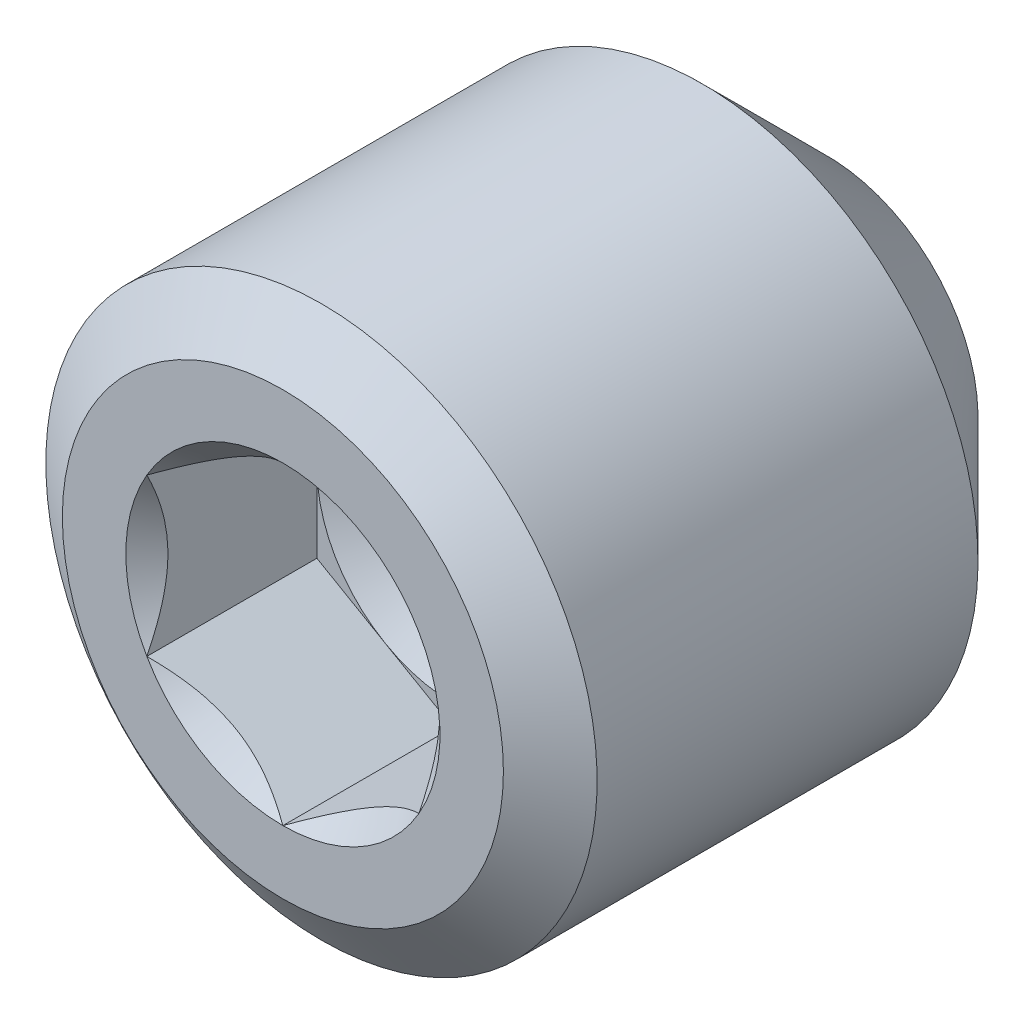
ISO-10303-21;
HEADER;
FILE_DESCRIPTION(('STEP AP214'),'2;1');
FILE_NAME('part.step','',(''),(''),'','','');
FILE_SCHEMA(('AUTOMOTIVE_DESIGN { 1 0 10303 214 1 1 1 1 }'));
ENDSEC;
DATA;
#1=APPLICATION_CONTEXT('core data for automotive mechanical design processes');
#2=APPLICATION_PROTOCOL_DEFINITION('international standard','automotive_design',2000,#1);
#3=PRODUCT_CONTEXT('',#1,'mechanical');
#4=PRODUCT('Part','Part','',(#3));
#5=PRODUCT_RELATED_PRODUCT_CATEGORY('part','',(#4));
#6=PRODUCT_DEFINITION_FORMATION('','',#4);
#7=PRODUCT_DEFINITION_CONTEXT('part definition',#1,'design');
#8=PRODUCT_DEFINITION('design','',#6,#7);
#9=PRODUCT_DEFINITION_SHAPE('','',#8);
#10=(LENGTH_UNIT() NAMED_UNIT(*) SI_UNIT(.MILLI.,.METRE.));
#11=(NAMED_UNIT(*) PLANE_ANGLE_UNIT() SI_UNIT($,.RADIAN.));
#12=(NAMED_UNIT(*) SI_UNIT($,.STERADIAN.) SOLID_ANGLE_UNIT());
#13=UNCERTAINTY_MEASURE_WITH_UNIT(LENGTH_MEASURE(1.E-05),#10,'distance_accuracy_value','');
#14=(GEOMETRIC_REPRESENTATION_CONTEXT(3) GLOBAL_UNCERTAINTY_ASSIGNED_CONTEXT((#13)) GLOBAL_UNIT_ASSIGNED_CONTEXT((#10,
#11,#12)) REPRESENTATION_CONTEXT('',''));
#15=CARTESIAN_POINT('',(0.,0.,0.));
#16=DIRECTION('',(0.,0.,1.));
#17=DIRECTION('',(1.,0.,0.));
#18=AXIS2_PLACEMENT_3D('',#15,#16,#17);
#19=CARTESIAN_POINT('',(0.,0.,0.495727982126937));
#20=DIRECTION('',(0.,0.,1.));
#21=DIRECTION('',(0.,-1.,0.));
#22=AXIS2_PLACEMENT_3D('',#19,#20,#21);
#23=CONICAL_SURFACE('',#22,1.19062499987876,1.04719755103086);
#24=CARTESIAN_POINT('',(2.55795384873636E-10,0.,-0.19167968210354));
#25=VERTEX_POINT('',#24);
#26=VERTEX_LOOP('',#25);
#27=FACE_BOUND('',#26,.T.);
#28=CARTESIAN_POINT('',(0.,0.,0.495727982192574));
#29=DIRECTION('',(0.,0.,1.));
#30=DIRECTION('',(0.,-1.,0.));
#31=AXIS2_PLACEMENT_3D('',#28,#29,#30);
#32=CIRCLE('',#31,1.19062499999245);
#33=CARTESIAN_POINT('',(1.19062499999623,0.,0.495727982183542));
#34=VERTEX_POINT('',#33);
#35=CARTESIAN_POINT('',(0.595312499998112,-1.03111149637757,0.495727982183542));
#36=VERTEX_POINT('',#35);
#37=EDGE_CURVE('E100',#34,#36,#32,.F.);
#38=ORIENTED_EDGE('',*,*,#37,.F.);
#39=CARTESIAN_POINT('',(0.,0.,0.495727982192574));
#40=DIRECTION('',(0.,0.,1.));
#41=DIRECTION('',(0.,-1.,0.));
#42=AXIS2_PLACEMENT_3D('',#39,#40,#41);
#43=CIRCLE('',#42,1.19062499999245);
#44=CARTESIAN_POINT('',(0.59531249999812,1.03111149637759,0.495727982183542));
#45=VERTEX_POINT('',#44);
#46=EDGE_CURVE('E114',#45,#34,#43,.F.);
#47=ORIENTED_EDGE('',*,*,#46,.F.);
#48=CARTESIAN_POINT('',(0.,0.,0.495727982192574));
#49=DIRECTION('',(0.,0.,1.));
#50=DIRECTION('',(0.,-1.,0.));
#51=AXIS2_PLACEMENT_3D('',#48,#49,#50);
#52=CIRCLE('',#51,1.19062499999245);
#53=CARTESIAN_POINT('',(-0.595312499998102,1.0311114963776,0.495727982183538));
#54=VERTEX_POINT('',#53);
#55=EDGE_CURVE('E252',#54,#45,#52,.F.);
#56=ORIENTED_EDGE('',*,*,#55,.F.);
#57=CARTESIAN_POINT('',(0.,0.,0.495727982192574));
#58=DIRECTION('',(0.,0.,1.));
#59=DIRECTION('',(0.,-1.,0.));
#60=AXIS2_PLACEMENT_3D('',#57,#58,#59);
#61=CIRCLE('',#60,1.19062499999245);
#62=CARTESIAN_POINT('',(-1.19062499999622,1.30013777685213E-13,0.495727982183538));
#63=VERTEX_POINT('',#62);
#64=EDGE_CURVE('E151',#63,#54,#61,.F.);
#65=ORIENTED_EDGE('',*,*,#64,.F.);
#66=CARTESIAN_POINT('',(0.,0.,0.495727982192574));
#67=DIRECTION('',(0.,0.,1.));
#68=DIRECTION('',(0.,-1.,0.));
#69=AXIS2_PLACEMENT_3D('',#66,#67,#68);
#70=CIRCLE('',#69,1.19062499999245);
#71=CARTESIAN_POINT('',(-0.595312499998087,-1.03111149637758,0.495727982183542));
#72=VERTEX_POINT('',#71);
#73=EDGE_CURVE('E19',#72,#63,#70,.F.);
#74=ORIENTED_EDGE('',*,*,#73,.F.);
#75=CARTESIAN_POINT('',(0.,0.,0.495727982192574));
#76=DIRECTION('',(0.,0.,1.));
#77=DIRECTION('',(0.,-1.,0.));
#78=AXIS2_PLACEMENT_3D('',#75,#76,#77);
#79=CIRCLE('',#78,1.19062499999245);
#80=EDGE_CURVE('E372',#36,#72,#79,.F.);
#81=ORIENTED_EDGE('',*,*,#80,.F.);
#82=EDGE_LOOP('',(#38,#47,#56,#65,#74,#81));
#83=FACE_BOUND('',#82,.T.);
#84=ADVANCED_FACE('F16',(#27,#83),#23,.F.);
#85=CARTESIAN_POINT('',(-1.190625,2.06222299276171,0.49572798217451));
#86=DIRECTION('',(0.,0.,1.));
#87=DIRECTION('',(0.,-1.,0.));
#88=AXIS2_PLACEMENT_3D('',#85,#86,#87);
#89=PLANE('',#88);
#90=DIRECTION('',(0.,-1.,0.));
#91=VECTOR('',#90,1.);
#92=CARTESIAN_POINT('',(-1.190625,0.687407664253913,0.49572798217451));
#93=LINE('',#92,#91);
#94=CARTESIAN_POINT('',(-1.19062500000001,-0.687407664253882,0.49572798217451));
#95=VERTEX_POINT('',#94);
#96=EDGE_CURVE('E83',#63,#95,#93,.T.);
#97=ORIENTED_EDGE('',*,*,#96,.T.);
#98=DIRECTION('',(0.866025403784438,-0.500000000000001,0.));
#99=VECTOR('',#98,1.);
#100=CARTESIAN_POINT('',(-1.190625,-0.687407664253889,0.49572798217451));
#101=LINE('',#100,#99);
#102=EDGE_CURVE('E167',#95,#72,#101,.T.);
#103=ORIENTED_EDGE('',*,*,#102,.T.);
#104=ORIENTED_EDGE('',*,*,#73,.T.);
#105=EDGE_LOOP('',(#97,#103,#104));
#106=FACE_BOUND('',#105,.T.);
#107=ADVANCED_FACE('F269',(#106),#89,.T.);
#108=CARTESIAN_POINT('',(-1.190625,2.06222299276171,0.49572798217451));
#109=DIRECTION('',(0.,0.,1.));
#110=DIRECTION('',(0.,-1.,0.));
#111=AXIS2_PLACEMENT_3D('',#108,#109,#110);
#112=PLANE('',#111);
#113=DIRECTION('',(0.866025403784438,-0.500000000000001,0.));
#114=VECTOR('',#113,1.);
#115=CARTESIAN_POINT('',(-1.190625,-0.687407664253889,0.495727982174503));
#116=LINE('',#115,#114);
#117=CARTESIAN_POINT('',(0.,-1.37481532850779,0.495727982174507));
#118=VERTEX_POINT('',#117);
#119=EDGE_CURVE('E133',#72,#118,#116,.T.);
#120=ORIENTED_EDGE('',*,*,#119,.T.);
#121=DIRECTION('',(0.866025403784439,0.5,0.));
#122=VECTOR('',#121,1.);
#123=CARTESIAN_POINT('',(0.,-1.37481532850779,0.49572798217451));
#124=LINE('',#123,#122);
#125=EDGE_CURVE('E105',#118,#36,#124,.T.);
#126=ORIENTED_EDGE('',*,*,#125,.T.);
#127=ORIENTED_EDGE('',*,*,#80,.T.);
#128=EDGE_LOOP('',(#120,#126,#127));
#129=FACE_BOUND('',#128,.T.);
#130=ADVANCED_FACE('F267',(#129),#112,.T.);
#131=CARTESIAN_POINT('',(-1.190625,2.06222299276171,0.49572798217451));
#132=DIRECTION('',(0.,0.,1.));
#133=DIRECTION('',(0.,-1.,0.));
#134=AXIS2_PLACEMENT_3D('',#131,#132,#133);
#135=PLANE('',#134);
#136=DIRECTION('',(0.866025403784439,0.5,0.));
#137=VECTOR('',#136,1.);
#138=CARTESIAN_POINT('',(0.,-1.37481532850779,0.49572798217451));
#139=LINE('',#138,#137);
#140=CARTESIAN_POINT('',(1.19062500000001,-0.687407664253884,0.49572798217451));
#141=VERTEX_POINT('',#140);
#142=EDGE_CURVE('E95',#36,#141,#139,.T.);
#143=ORIENTED_EDGE('',*,*,#142,.T.);
#144=DIRECTION('',(0.,1.,0.));
#145=VECTOR('',#144,1.);
#146=CARTESIAN_POINT('',(1.19062500000001,-0.687407664253889,0.49572798217451));
#147=LINE('',#146,#145);
#148=EDGE_CURVE('E98',#141,#34,#147,.T.);
#149=ORIENTED_EDGE('',*,*,#148,.T.);
#150=ORIENTED_EDGE('',*,*,#37,.T.);
#151=EDGE_LOOP('',(#143,#149,#150));
#152=FACE_BOUND('',#151,.T.);
#153=ADVANCED_FACE('F97',(#152),#135,.T.);
#154=CARTESIAN_POINT('',(-1.190625,2.06222299276171,0.49572798217451));
#155=DIRECTION('',(0.,0.,1.));
#156=DIRECTION('',(0.,-1.,0.));
#157=AXIS2_PLACEMENT_3D('',#154,#155,#156);
#158=PLANE('',#157);
#159=DIRECTION('',(0.,1.,0.));
#160=VECTOR('',#159,1.);
#161=CARTESIAN_POINT('',(1.19062500000001,-0.687407664253889,0.495727982174509));
#162=LINE('',#161,#160);
#163=CARTESIAN_POINT('',(1.19062500000003,0.687407664253898,0.495727982174509));
#164=VERTEX_POINT('',#163);
#165=EDGE_CURVE('E113',#34,#164,#162,.T.);
#166=ORIENTED_EDGE('',*,*,#165,.T.);
#167=DIRECTION('',(-0.866025403784438,0.500000000000001,0.));
#168=VECTOR('',#167,1.);
#169=CARTESIAN_POINT('',(1.19062500000001,0.687407664253913,0.49572798217451));
#170=LINE('',#169,#168);
#171=EDGE_CURVE('E124',#164,#45,#170,.T.);
#172=ORIENTED_EDGE('',*,*,#171,.T.);
#173=ORIENTED_EDGE('',*,*,#46,.T.);
#174=EDGE_LOOP('',(#166,#172,#173));
#175=FACE_BOUND('',#174,.T.);
#176=ADVANCED_FACE('F260',(#175),#158,.T.);
#177=CARTESIAN_POINT('',(1.19062500000001,-0.687407664253889,0.49572798217451));
#178=DIRECTION('',(1.,0.,0.));
#179=DIRECTION('',(0.,1.,0.));
#180=AXIS2_PLACEMENT_3D('',#177,#178,#179);
#181=PLANE('',#180);
#182=CARTESIAN_POINT('',(1.19062499999567,0.687407664292412,1.98400923211493));
#183=CARTESIAN_POINT('',(1.19062499999845,0.64046328207789,1.96055894231477));
#184=CARTESIAN_POINT('',(1.19062499999959,0.592738991388445,1.9384779182468));
#185=CARTESIAN_POINT('',(1.19062500000044,0.495406225216116,1.89800295513959));
#186=CARTESIAN_POINT('',(1.19062500000013,0.44578762950972,1.87963356850329));
#187=CARTESIAN_POINT('',(1.1906249999999,0.345116375712698,1.84791358583569));
#188=CARTESIAN_POINT('',(1.19062499999999,0.294069215443057,1.83454600462254));
#189=CARTESIAN_POINT('',(1.19062500000004,0.190855854638069,1.81396603547193));
#190=CARTESIAN_POINT('',(1.19062500000002,0.138693632939681,1.80673461351588));
#191=CARTESIAN_POINT('',(1.19062500000001,0.0719511128628457,1.80190389372895));
#192=CARTESIAN_POINT('',(1.19062500000001,0.0575681065477679,1.80112291749238));
#193=CARTESIAN_POINT('',(1.19062500000001,0.0287907386471924,1.80008032792779));
#194=CARTESIAN_POINT('',(1.19062500000001,0.0143963874866042,1.79981843246661));
#195=CARTESIAN_POINT('',(1.19062500000001,-0.0361321030513867,1.79982008619966));
#196=CARTESIAN_POINT('',(1.19062500000001,-0.0722770331511759,1.80147394594884));
#197=CARTESIAN_POINT('',(1.19062500000001,-0.144284982609329,1.80799116289963));
#198=CARTESIAN_POINT('',(1.19062500000001,-0.180147787674807,1.81285675864882));
#199=CARTESIAN_POINT('',(1.19062500000001,-0.287258251714067,1.83196696983393));
#200=CARTESIAN_POINT('',(1.19062500000001,-0.35772529740189,1.85072176782421));
#201=CARTESIAN_POINT('',(1.19062500000001,-0.471552892507442,1.88908925370762));
#202=CARTESIAN_POINT('',(1.19062500000001,-0.515840765958847,1.90614997876308));
#203=CARTESIAN_POINT('',(1.19062500000001,-0.602739573147029,1.94312607455083));
#204=CARTESIAN_POINT('',(1.19062500000001,-0.645362139970547,1.96301390794479));
#205=CARTESIAN_POINT('',(1.19062500000001,-0.687407664293118,1.98400923211292));
#206=B_SPLINE_CURVE_WITH_KNOTS('',3,(#182,#183,#184,#185,#186,#187,#188,#189,#190,#191,#192,
#193,#194,#195,#196,#197,#198,#199,#200,#201,#202,#203,#204,#205),.UNSPECIFIED.,.F.,.F.,(4,2,2,
2,2,2,2,2,2,2,2,4),(0.,0.157535403142992,0.316081041540045,0.474083294698365,0.631593623243647,
0.674799715139207,0.717982317014592,0.826362160391399,0.934817623300469,1.15262451060987,
1.29491478060776,1.43590359051227),.UNSPECIFIED.);
#207=CARTESIAN_POINT('',(1.19062500005789,0.687407664240221,1.98400923213658));
#208=VERTEX_POINT('',#207);
#209=CARTESIAN_POINT('',(1.19062500002894,-0.687407664270611,1.98400923212671));
#210=VERTEX_POINT('',#209);
#211=EDGE_CURVE('E159',#208,#210,#206,.T.);
#212=ORIENTED_EDGE('',*,*,#211,.F.);
#213=DIRECTION('',(0.,0.,1.));
#214=VECTOR('',#213,1.);
#215=CARTESIAN_POINT('',(1.19062500000003,0.687407664253898,0.49572798217451));
#216=LINE('',#215,#214);
#217=EDGE_CURVE('E139',#208,#164,#216,.F.);
#218=ORIENTED_EDGE('',*,*,#217,.T.);
#219=ORIENTED_EDGE('',*,*,#165,.F.);
#220=ORIENTED_EDGE('',*,*,#148,.F.);
#221=DIRECTION('',(0.,0.,1.));
#222=VECTOR('',#221,1.);
#223=CARTESIAN_POINT('',(1.19062500000001,-0.687407664253884,0.49572798217451));
#224=LINE('',#223,#222);
#225=EDGE_CURVE('E104',#141,#210,#224,.T.);
#226=ORIENTED_EDGE('',*,*,#225,.T.);
#227=EDGE_LOOP('',(#212,#218,#219,#220,#226));
#228=FACE_BOUND('',#227,.T.);
#229=ADVANCED_FACE('F110',(#228),#181,.F.);
#230=CARTESIAN_POINT('',(-1.190625,2.06222299276171,0.49572798217451));
#231=DIRECTION('',(0.,0.,1.));
#232=DIRECTION('',(0.,-1.,0.));
#233=AXIS2_PLACEMENT_3D('',#230,#231,#232);
#234=PLANE('',#233);
#235=DIRECTION('',(-0.866025403784438,0.500000000000001,0.));
#236=VECTOR('',#235,1.);
#237=CARTESIAN_POINT('',(1.19062500000001,0.687407664253913,0.495727982174503));
#238=LINE('',#237,#236);
#239=CARTESIAN_POINT('',(0.,1.37481532850782,0.495727982174503));
#240=VERTEX_POINT('',#239);
#241=EDGE_CURVE('E136',#45,#240,#238,.T.);
#242=ORIENTED_EDGE('',*,*,#241,.T.);
#243=DIRECTION('',(-0.866025403784439,-0.5,0.));
#244=VECTOR('',#243,1.);
#245=CARTESIAN_POINT('',(0.,1.37481532850781,0.495727982174503));
#246=LINE('',#245,#244);
#247=EDGE_CURVE('E142',#240,#54,#246,.T.);
#248=ORIENTED_EDGE('',*,*,#247,.T.);
#249=ORIENTED_EDGE('',*,*,#55,.T.);
#250=EDGE_LOOP('',(#242,#248,#249));
#251=FACE_BOUND('',#250,.T.);
#252=ADVANCED_FACE('F259',(#251),#234,.T.);
#253=CARTESIAN_POINT('',(-1.190625,2.06222299276171,0.49572798217451));
#254=DIRECTION('',(0.,0.,1.));
#255=DIRECTION('',(0.,-1.,0.));
#256=AXIS2_PLACEMENT_3D('',#253,#254,#255);
#257=PLANE('',#256);
#258=DIRECTION('',(-0.866025403784439,-0.5,0.));
#259=VECTOR('',#258,1.);
#260=CARTESIAN_POINT('',(0.,1.37481532850781,0.495727982174501));
#261=LINE('',#260,#259);
#262=CARTESIAN_POINT('',(-1.190625,0.687407664253916,0.495727982174502));
#263=VERTEX_POINT('',#262);
#264=EDGE_CURVE('E145',#54,#263,#261,.T.);
#265=ORIENTED_EDGE('',*,*,#264,.T.);
#266=DIRECTION('',(0.,-1.,0.));
#267=VECTOR('',#266,1.);
#268=CARTESIAN_POINT('',(-1.190625,0.687407664253913,0.495727982174503));
#269=LINE('',#268,#267);
#270=EDGE_CURVE('E148',#263,#63,#269,.T.);
#271=ORIENTED_EDGE('',*,*,#270,.T.);
#272=ORIENTED_EDGE('',*,*,#64,.T.);
#273=EDGE_LOOP('',(#265,#271,#272));
#274=FACE_BOUND('',#273,.T.);
#275=ADVANCED_FACE('F358',(#274),#257,.T.);
#276=CARTESIAN_POINT('',(-1.190625,0.687407664253913,0.495727982174503));
#277=DIRECTION('',(-1.,0.,0.));
#278=DIRECTION('',(0.,-1.,0.));
#279=AXIS2_PLACEMENT_3D('',#276,#277,#278);
#280=PLANE('',#279);
#281=CARTESIAN_POINT('',(-1.19062499999689,0.687407664295069,1.98400923211557));
#282=CARTESIAN_POINT('',(-1.19062499999888,0.640154592187732,1.96040536744382));
#283=CARTESIAN_POINT('',(-1.1906249999997,0.592111444465279,1.93818802847305));
#284=CARTESIAN_POINT('',(-1.1906250000003,0.494146535985991,1.89750902941694));
#285=CARTESIAN_POINT('',(-1.19062500000008,0.444215463852093,1.87906999571823));
#286=CARTESIAN_POINT('',(-1.19062499999992,0.34353191261821,1.84748380274731));
#287=CARTESIAN_POINT('',(-1.19062499999998,0.292805060660136,1.83425727427473));
#288=CARTESIAN_POINT('',(-1.19062500000002,0.19023488957445,1.81387930355028));
#289=CARTESIAN_POINT('',(-1.190625,0.138394701629495,1.80671265556526));
#290=CARTESIAN_POINT('',(-1.19062499999999,0.0490434171471756,1.80024610055994));
#291=CARTESIAN_POINT('',(-1.190625,0.0116476312291625,1.79928918177737));
#292=CARTESIAN_POINT('',(-1.190625,-0.0630781169061416,1.80090396128143));
#293=CARTESIAN_POINT('',(-1.190625,-0.100408062759505,1.80347643902957));
#294=CARTESIAN_POINT('',(-1.190625,-0.174707550763351,1.81200130363095));
#295=CARTESIAN_POINT('',(-1.190625,-0.211676725216807,1.81795683341918));
#296=CARTESIAN_POINT('',(-1.190625,-0.284997830944034,1.83292705321312));
#297=CARTESIAN_POINT('',(-1.190625,-0.321349490320898,1.84194305589422));
#298=CARTESIAN_POINT('',(-1.190625,-0.414409407701737,1.86868846791361));
#299=CARTESIAN_POINT('',(-1.190625,-0.47053205911329,1.88842523325998));
#300=CARTESIAN_POINT('',(-1.190625,-0.580581647456373,1.93288237138799));
#301=CARTESIAN_POINT('',(-1.190625,-0.634515062273283,1.95758652132262));
#302=CARTESIAN_POINT('',(-1.190625,-0.687407664295433,1.98400923211406));
#303=B_SPLINE_CURVE_WITH_KNOTS('',3,(#281,#282,#283,#284,#285,#286,#287,#288,#289,#290,#291,
#292,#293,#294,#295,#296,#297,#298,#299,#300,#301,#302),.UNSPECIFIED.,.F.,.F.,(4,2,2,2,2,2,2,2,
2,2,4),(0.,0.158570945782174,0.318065397827539,0.475027617267219,0.631594801071171,
0.743660160759135,0.855750273884749,0.967944692071428,1.08018729279008,1.25836291045195,
1.43596581394394),.UNSPECIFIED.);
#304=CARTESIAN_POINT('',(-1.19062500002893,0.687407664270642,1.98400923212671));
#305=VERTEX_POINT('',#304);
#306=CARTESIAN_POINT('',(-1.19062500005789,-0.687407664241365,1.98400923213716));
#307=VERTEX_POINT('',#306);
#308=EDGE_CURVE('E313',#305,#307,#303,.T.);
#309=ORIENTED_EDGE('',*,*,#308,.T.);
#310=DIRECTION('',(0.,0.,1.));
#311=VECTOR('',#310,1.);
#312=CARTESIAN_POINT('',(-1.19062500000001,-0.687407664253882,0.49572798217451));
#313=LINE('',#312,#311);
#314=EDGE_CURVE('E131',#307,#95,#313,.F.);
#315=ORIENTED_EDGE('',*,*,#314,.T.);
#316=ORIENTED_EDGE('',*,*,#96,.F.);
#317=ORIENTED_EDGE('',*,*,#270,.F.);
#318=DIRECTION('',(0.,0.,1.));
#319=VECTOR('',#318,1.);
#320=CARTESIAN_POINT('',(-1.190625,0.687407664253916,0.495727982174503));
#321=LINE('',#320,#319);
#322=EDGE_CURVE('E155',#263,#305,#321,.T.);
#323=ORIENTED_EDGE('',*,*,#322,.T.);
#324=EDGE_LOOP('',(#309,#315,#316,#317,#323));
#325=FACE_BOUND('',#324,.T.);
#326=ADVANCED_FACE('F330',(#325),#280,.F.);
#327=CARTESIAN_POINT('',(-1.190625,-0.687407664253889,0.49572798217451));
#328=DIRECTION('',(-0.500000000000001,-0.866025403784438,0.));
#329=DIRECTION('',(0.866025403784438,-0.500000000000001,0.));
#330=AXIS2_PLACEMENT_3D('',#327,#328,#329);
#331=PLANE('',#330);
#332=CARTESIAN_POINT('',(-1.19062500003409,-0.687407664230629,1.98400923211556));
#333=CARTESIAN_POINT('',(-1.14970263918327,-0.711034200286016,1.96040536744382));
#334=CARTESIAN_POINT('',(-1.10809605277826,-0.73505577414795,1.93818802847304));
#335=CARTESIAN_POINT('',(-1.02325595335608,-0.784038228388114,1.89750902941694));
#336=CARTESIAN_POINT('',(-0.980014376449825,-0.809003764454871,1.87906999571824));
#337=CARTESIAN_POINT('',(-0.892819863337972,-0.859345540071674,1.84748380274731));
#338=CARTESIAN_POINT('',(-0.848889120888296,-0.884708966050761,1.83425727427474));
#339=CARTESIAN_POINT('',(-0.760060747057598,-0.93599405159364,1.81387930355029));
#340=CARTESIAN_POINT('',(-0.7151658273603,-0.961914145566103,1.80671265556527));
#341=CARTESIAN_POINT('',(-0.637785345137838,-1.00658978780726,1.80024610055994));
#342=CARTESIAN_POINT('',(-0.605399644538355,-1.02528768076626,1.79928918177737));
#343=CARTESIAN_POINT('',(-0.540685248336385,-1.06265055483392,1.80090396128143));
#344=CARTESIAN_POINT('',(-0.508356566905474,-1.0813155277606,1.80347643902958));
#345=CARTESIAN_POINT('',(-0.444011322805966,-1.11846527176252,1.81200130363096));
#346=CARTESIAN_POINT('',(-0.411995078572333,-1.13694985898925,1.81795683341919));
#347=CARTESIAN_POINT('',(-0.348497138378991,-1.17361041185286,1.83292705321313));
#348=CARTESIAN_POINT('',(-0.317015677888907,-1.1917862415413,1.84194305589423));
#349=CARTESIAN_POINT('',(-0.23642342536302,-1.23831620023172,1.86868846791362));
#350=CARTESIAN_POINT('',(-0.187819783512878,-1.26637752593749,1.88842523325998));
#351=CARTESIAN_POINT('',(-0.0925140443317499,-1.32140232010903,1.932882371388));
#352=CARTESIAN_POINT('',(-0.0458063369874632,-1.34836902751749,1.95758652132262));
#353=CARTESIAN_POINT('',(3.59776575595635E-11,-1.37481532852856,1.98400923211406));
#354=B_SPLINE_CURVE_WITH_KNOTS('',3,(#332,#333,#334,#335,#336,#337,#338,#339,#340,#341,#342,
#343,#344,#345,#346,#347,#348,#349,#350,#351,#352,#353),.UNSPECIFIED.,.F.,.F.,(4,2,2,2,2,2,2,2,
2,2,4),(0.,0.158570945782172,0.318065397827535,0.475027617267213,0.631594801071163,
0.743660160759127,0.855750273884742,0.967944692071422,1.08018729279007,1.25836291045194,
1.43596581394393),.UNSPECIFIED.);
#355=CARTESIAN_POINT('',(-3.97893440011964E-11,-1.37481532855166,1.98400923213716));
#356=VERTEX_POINT('',#355);
#357=EDGE_CURVE('E318',#307,#356,#354,.T.);
#358=ORIENTED_EDGE('',*,*,#357,.T.);
#359=DIRECTION('',(0.,0.,1.));
#360=VECTOR('',#359,1.);
#361=CARTESIAN_POINT('',(0.,-1.3748153285078,0.49572798217451));
#362=LINE('',#361,#360);
#363=EDGE_CURVE('E121',#356,#118,#362,.F.);
#364=ORIENTED_EDGE('',*,*,#363,.T.);
#365=ORIENTED_EDGE('',*,*,#119,.F.);
#366=ORIENTED_EDGE('',*,*,#102,.F.);
#367=ORIENTED_EDGE('',*,*,#314,.F.);
#368=EDGE_LOOP('',(#358,#364,#365,#366,#367));
#369=FACE_BOUND('',#368,.T.);
#370=ADVANCED_FACE('F351',(#369),#331,.F.);
#371=CARTESIAN_POINT('',(0.,-1.37481532850779,0.49572798217451));
#372=DIRECTION('',(0.5,-0.866025403784439,0.));
#373=DIRECTION('',(0.866025403784439,0.5,0.));
#374=AXIS2_PLACEMENT_3D('',#371,#372,#373);
#375=PLANE('',#374);
#376=CARTESIAN_POINT('',(-3.7187299035962E-11,-1.37481532852568,1.98400923211557));
#377=CARTESIAN_POINT('',(0.0409223608156151,-1.35118879247373,1.96040536744382));
#378=CARTESIAN_POINT('',(0.0825289472214342,-1.32716721861321,1.93818802847305));
#379=CARTESIAN_POINT('',(0.167369046644212,-1.27818476437409,1.89750902941694));
#380=CARTESIAN_POINT('',(0.210610623550247,-1.25321922830695,1.87906999571824));
#381=CARTESIAN_POINT('',(0.297805136661942,-1.20287745268987,1.84748380274731));
#382=CARTESIAN_POINT('',(0.341735879111678,-1.17751402671088,1.83425727427474));
#383=CARTESIAN_POINT('',(0.430564252942422,-1.12622894116808,1.81387930355029));
#384=CARTESIAN_POINT('',(0.475459172639706,-1.10030884719558,1.80671265556527));
#385=CARTESIAN_POINT('',(0.552839654862164,-1.05563320495441,1.80024610055994));
#386=CARTESIAN_POINT('',(0.58522535546165,-1.03693531199541,1.79928918177737));
#387=CARTESIAN_POINT('',(0.649939751663623,-0.999572437927758,1.80090396128143));
#388=CARTESIAN_POINT('',(0.682268433094534,-0.980907465001075,1.80347643902958));
#389=CARTESIAN_POINT('',(0.746613677194042,-0.943757720999152,1.81200130363096));
#390=CARTESIAN_POINT('',(0.778629921427674,-0.925273133772424,1.81795683341919));
#391=CARTESIAN_POINT('',(0.842127861621015,-0.888612580908812,1.83292705321313));
#392=CARTESIAN_POINT('',(0.873609322111098,-0.87043675122038,1.84194305589423));
#393=CARTESIAN_POINT('',(0.954201574636604,-0.82390679253018,1.86868846791349));
#394=CARTESIAN_POINT('',(1.00280521648638,-0.795845466824616,1.88842523325968));
#395=CARTESIAN_POINT('',(1.0981109556668,-0.740820672653482,1.93288237138728));
#396=CARTESIAN_POINT('',(1.14481866301075,-0.713853965245223,1.95758652132166));
#397=CARTESIAN_POINT('',(1.19062500003387,-0.687407664234335,1.98400923211284));
#398=B_SPLINE_CURVE_WITH_KNOTS('',3,(#376,#377,#378,#379,#380,#381,#382,#383,#384,#385,#386,
#387,#388,#389,#390,#391,#392,#393,#394,#395,#396,#397),.UNSPECIFIED.,.F.,.F.,(4,2,2,2,2,2,2,2,
2,2,4),(0.,0.158570945782166,0.318065397827523,0.475027617267209,0.631594801071167,
0.743660160759134,0.855750273884751,0.967944692071429,1.08018729279008,1.25836291045058,
1.43596581394121),.UNSPECIFIED.);
#399=EDGE_CURVE('E119',#356,#210,#398,.T.);
#400=ORIENTED_EDGE('',*,*,#399,.T.);
#401=ORIENTED_EDGE('',*,*,#225,.F.);
#402=ORIENTED_EDGE('',*,*,#142,.F.);
#403=ORIENTED_EDGE('',*,*,#125,.F.);
#404=ORIENTED_EDGE('',*,*,#363,.F.);
#405=EDGE_LOOP('',(#400,#401,#402,#403,#404));
#406=FACE_BOUND('',#405,.T.);
#407=ADVANCED_FACE('F116',(#406),#375,.F.);
#408=CARTESIAN_POINT('',(1.19062500000001,0.687407664253913,0.49572798217451));
#409=DIRECTION('',(0.500000000000001,0.866025403784438,0.));
#410=DIRECTION('',(-0.866025403784438,0.500000000000001,0.));
#411=AXIS2_PLACEMENT_3D('',#408,#409,#410);
#412=PLANE('',#411);
#413=CARTESIAN_POINT('',(1.19062500003121,0.687407664230863,1.98400923211496));
#414=CARTESIAN_POINT('',(1.14970263918109,0.711034200286776,1.96040536744301));
#415=CARTESIAN_POINT('',(1.10809605277648,0.735055774148869,1.93818802847223));
#416=CARTESIAN_POINT('',(1.02325595335481,0.784038228389021,1.89750902941629));
#417=CARTESIAN_POINT('',(0.98001437644867,0.809003764455603,1.87906999571776));
#418=CARTESIAN_POINT('',(0.892819863337155,0.859345540072137,1.84748380274708));
#419=CARTESIAN_POINT('',(0.848889120887694,0.884708966051127,1.83425727427459));
#420=CARTESIAN_POINT('',(0.760060747057411,0.935994051593785,1.81387930355026));
#421=CARTESIAN_POINT('',(0.715165827360314,0.961914145566125,1.80671265556529));
#422=CARTESIAN_POINT('',(0.637785345138079,1.00658978780714,1.80024610055996));
#423=CARTESIAN_POINT('',(0.605399644538619,1.02528768076614,1.79928918177738));
#424=CARTESIAN_POINT('',(0.540685248336694,1.06265055483377,1.80090396128142));
#425=CARTESIAN_POINT('',(0.508356566905804,1.08131552776044,1.80347643902955));
#426=CARTESIAN_POINT('',(0.444011322806335,1.11846527176234,1.8120013036309));
#427=CARTESIAN_POINT('',(0.411995078572721,1.13694985898905,1.81795683341912));
#428=CARTESIAN_POINT('',(0.348497138379412,1.17361041185265,1.83292705321302));
#429=CARTESIAN_POINT('',(0.317015677889345,1.19178624154107,1.8419430558941));
#430=CARTESIAN_POINT('',(0.236423425363389,1.23831620023153,1.86868846791348));
#431=CARTESIAN_POINT('',(0.187819783513164,1.26637752593735,1.88842523325986));
#432=CARTESIAN_POINT('',(0.0925140443318827,1.32140232010898,1.93288237138793));
#433=CARTESIAN_POINT('',(0.0458063369875248,1.34836902751748,1.9575865213226));
#434=CARTESIAN_POINT('',(-3.59844204254258E-11,1.37481532852859,1.98400923211407));
#435=B_SPLINE_CURVE_WITH_KNOTS('',3,(#413,#414,#415,#416,#417,#418,#419,#420,#421,#422,#423,
#424,#425,#426,#427,#428,#429,#430,#431,#432,#433,#434),.UNSPECIFIED.,.F.,.F.,(4,2,2,2,2,2,2,2,
2,2,4),(0.,0.158570945781483,0.318065397826116,0.475027617265063,0.631594801068299,
0.743660160756186,0.855750273881723,0.967944692068335,1.08018729278692,1.25836291044907,
1.43596581394133),.UNSPECIFIED.);
#436=CARTESIAN_POINT('',(3.97830534634665E-11,1.37481532855168,1.98400923213717));
#437=VERTEX_POINT('',#436);
#438=EDGE_CURVE('E34',#208,#437,#435,.T.);
#439=ORIENTED_EDGE('',*,*,#438,.T.);
#440=DIRECTION('',(0.,0.,1.));
#441=VECTOR('',#440,1.);
#442=CARTESIAN_POINT('',(0.,1.37481532850782,0.495727982174503));
#443=LINE('',#442,#441);
#444=EDGE_CURVE('E311',#437,#240,#443,.F.);
#445=ORIENTED_EDGE('',*,*,#444,.T.);
#446=ORIENTED_EDGE('',*,*,#241,.F.);
#447=ORIENTED_EDGE('',*,*,#171,.F.);
#448=ORIENTED_EDGE('',*,*,#217,.F.);
#449=EDGE_LOOP('',(#439,#445,#446,#447,#448));
#450=FACE_BOUND('',#449,.T.);
#451=ADVANCED_FACE('F350',(#450),#412,.F.);
#452=CARTESIAN_POINT('',(0.,1.37481532850781,0.495727982174503));
#453=DIRECTION('',(-0.5,0.866025403784439,0.));
#454=DIRECTION('',(-0.866025403784439,-0.5,0.));
#455=AXIS2_PLACEMENT_3D('',#452,#453,#454);
#456=PLANE('',#455);
#457=CARTESIAN_POINT('',(3.7170576648238E-11,1.37481532852571,1.98400923211556));
#458=CARTESIAN_POINT('',(-0.0409223608156309,1.35118879247375,1.96040536744381));
#459=CARTESIAN_POINT('',(-0.0825289472214504,1.32716721861323,1.93818802847304));
#460=CARTESIAN_POINT('',(-0.16736904664423,1.2781847643741,1.89750902941694));
#461=CARTESIAN_POINT('',(-0.210610623550268,1.25321922830696,1.87906999571824));
#462=CARTESIAN_POINT('',(-0.297805136661962,1.20287745268989,1.84748380274731));
#463=CARTESIAN_POINT('',(-0.341735879111695,1.1775140267109,1.83425727427474));
#464=CARTESIAN_POINT('',(-0.430564252942434,1.12622894116809,1.81387930355029));
#465=CARTESIAN_POINT('',(-0.475459172639716,1.1003088471956,1.80671265556527));
#466=CARTESIAN_POINT('',(-0.552839654862171,1.05563320495443,1.80024610055995));
#467=CARTESIAN_POINT('',(-0.585225355461656,1.03693531199543,1.79928918177738));
#468=CARTESIAN_POINT('',(-0.649939751663629,0.999572437927779,1.80090396128144));
#469=CARTESIAN_POINT('',(-0.682268433094539,0.980907465001097,1.80347643902958));
#470=CARTESIAN_POINT('',(-0.746613677194047,0.943757720999173,1.81200130363096));
#471=CARTESIAN_POINT('',(-0.77862992142768,0.925273133772445,1.81795683341919));
#472=CARTESIAN_POINT('',(-0.842127861621023,0.888612580908832,1.83292705321314));
#473=CARTESIAN_POINT('',(-0.873609322111106,0.870436751220399,1.84194305589423));
#474=CARTESIAN_POINT('',(-0.954201574636989,0.823906792529982,1.86868846791362));
#475=CARTESIAN_POINT('',(-1.00280521648713,0.795845466824209,1.88842523325999));
#476=CARTESIAN_POINT('',(-1.09811095566825,0.740820672652673,1.932882371388));
#477=CARTESIAN_POINT('',(-1.14481866301253,0.713853965244221,1.95758652132262));
#478=CARTESIAN_POINT('',(-1.19062500003597,0.687407664233148,1.98400923211406));
#479=B_SPLINE_CURVE_WITH_KNOTS('',3,(#457,#458,#459,#460,#461,#462,#463,#464,#465,#466,#467,
#468,#469,#470,#471,#472,#473,#474,#475,#476,#477,#478),.UNSPECIFIED.,.F.,.F.,(4,2,2,2,2,2,2,2,
2,2,4),(0.,0.158570945782171,0.318065397827532,0.47502761726721,0.631594801071159,
0.743660160759124,0.855750273884739,0.967944692071419,1.08018729279007,1.25836291045192,
1.4359658139439),.UNSPECIFIED.);
#480=EDGE_CURVE('E207',#437,#305,#479,.T.);
#481=ORIENTED_EDGE('',*,*,#480,.T.);
#482=ORIENTED_EDGE('',*,*,#322,.F.);
#483=ORIENTED_EDGE('',*,*,#264,.F.);
#484=ORIENTED_EDGE('',*,*,#247,.F.);
#485=ORIENTED_EDGE('',*,*,#444,.F.);
#486=EDGE_LOOP('',(#481,#482,#483,#484,#485));
#487=FACE_BOUND('',#486,.T.);
#488=ADVANCED_FACE('F221',(#487),#456,.F.);
#489=CARTESIAN_POINT('',(0.,0.,1.98400923216013));
#490=DIRECTION('',(0.,0.,1.));
#491=DIRECTION('',(1.,0.,0.));
#492=AXIS2_PLACEMENT_3D('',#489,#490,#491);
#493=CONICAL_SURFACE('',#492,1.37481532857464,0.785398163397448);
#494=ORIENTED_EDGE('',*,*,#308,.F.);
#495=CARTESIAN_POINT('',(0.,0.,1.98400923216013));
#496=DIRECTION('',(0.,0.,1.));
#497=DIRECTION('',(1.,0.,0.));
#498=AXIS2_PLACEMENT_3D('',#495,#496,#497);
#499=CIRCLE('',#498,1.37481532857464);
#500=EDGE_CURVE('E204',#305,#307,#499,.T.);
#501=ORIENTED_EDGE('',*,*,#500,.T.);
#502=EDGE_LOOP('',(#494,#501));
#503=FACE_BOUND('',#502,.T.);
#504=ADVANCED_FACE('F314',(#503),#493,.F.);
#505=CARTESIAN_POINT('',(0.,0.,1.98400923216013));
#506=DIRECTION('',(0.,0.,1.));
#507=DIRECTION('',(1.,0.,0.));
#508=AXIS2_PLACEMENT_3D('',#505,#506,#507);
#509=CONICAL_SURFACE('',#508,1.37481532857464,0.785398163397448);
#510=ORIENTED_EDGE('',*,*,#357,.F.);
#511=CARTESIAN_POINT('',(0.,0.,1.98400923216013));
#512=DIRECTION('',(0.,0.,1.));
#513=DIRECTION('',(1.,0.,0.));
#514=AXIS2_PLACEMENT_3D('',#511,#512,#513);
#515=CIRCLE('',#514,1.37481532857464);
#516=EDGE_CURVE('E201',#307,#356,#515,.T.);
#517=ORIENTED_EDGE('',*,*,#516,.T.);
#518=EDGE_LOOP('',(#510,#517));
#519=FACE_BOUND('',#518,.T.);
#520=ADVANCED_FACE('F334',(#519),#509,.F.);
#521=CARTESIAN_POINT('',(0.,0.,1.98400923216013));
#522=DIRECTION('',(0.,0.,1.));
#523=DIRECTION('',(1.,0.,0.));
#524=AXIS2_PLACEMENT_3D('',#521,#522,#523);
#525=CONICAL_SURFACE('',#524,1.37481532857464,0.785398163397448);
#526=ORIENTED_EDGE('',*,*,#399,.F.);
#527=CARTESIAN_POINT('',(0.,0.,1.98400923216013));
#528=DIRECTION('',(0.,0.,1.));
#529=DIRECTION('',(1.,0.,0.));
#530=AXIS2_PLACEMENT_3D('',#527,#528,#529);
#531=CIRCLE('',#530,1.37481532857464);
#532=EDGE_CURVE('E199',#356,#210,#531,.T.);
#533=ORIENTED_EDGE('',*,*,#532,.T.);
#534=EDGE_LOOP('',(#526,#533));
#535=FACE_BOUND('',#534,.T.);
#536=ADVANCED_FACE('F240',(#535),#525,.F.);
#537=CARTESIAN_POINT('',(0.,0.,1.98400923216013));
#538=DIRECTION('',(0.,0.,1.));
#539=DIRECTION('',(1.,0.,0.));
#540=AXIS2_PLACEMENT_3D('',#537,#538,#539);
#541=CONICAL_SURFACE('',#540,1.37481532857464,0.785398163550834);
#542=CARTESIAN_POINT('',(0.,0.,1.98400923216013));
#543=DIRECTION('',(0.,0.,1.));
#544=DIRECTION('',(1.,0.,0.));
#545=AXIS2_PLACEMENT_3D('',#542,#543,#544);
#546=CIRCLE('',#545,1.37481532857464);
#547=EDGE_CURVE('E196',#210,#208,#546,.T.);
#548=ORIENTED_EDGE('',*,*,#547,.T.);
#549=ORIENTED_EDGE('',*,*,#211,.T.);
#550=EDGE_LOOP('',(#548,#549));
#551=FACE_BOUND('',#550,.T.);
#552=ADVANCED_FACE('F235',(#551),#541,.F.);
#553=CARTESIAN_POINT('',(0.,0.,1.98400923216013));
#554=DIRECTION('',(0.,0.,1.));
#555=DIRECTION('',(1.,0.,0.));
#556=AXIS2_PLACEMENT_3D('',#553,#554,#555);
#557=CONICAL_SURFACE('',#556,1.37481532857464,0.785398163397448);
#558=ORIENTED_EDGE('',*,*,#438,.F.);
#559=CARTESIAN_POINT('',(0.,0.,1.98400923216013));
#560=DIRECTION('',(0.,0.,1.));
#561=DIRECTION('',(1.,0.,0.));
#562=AXIS2_PLACEMENT_3D('',#559,#560,#561);
#563=CIRCLE('',#562,1.37481532857464);
#564=EDGE_CURVE('E193',#208,#437,#563,.T.);
#565=ORIENTED_EDGE('',*,*,#564,.T.);
#566=EDGE_LOOP('',(#558,#565));
#567=FACE_BOUND('',#566,.T.);
#568=ADVANCED_FACE('F229',(#567),#557,.F.);
#569=CARTESIAN_POINT('',(0.,0.,1.98400923216013));
#570=DIRECTION('',(0.,0.,1.));
#571=DIRECTION('',(1.,0.,0.));
#572=AXIS2_PLACEMENT_3D('',#569,#570,#571);
#573=CONICAL_SURFACE('',#572,1.37481532857464,0.785398163397448);
#574=ORIENTED_EDGE('',*,*,#480,.F.);
#575=CARTESIAN_POINT('',(0.,0.,1.98400923216013));
#576=DIRECTION('',(0.,0.,1.));
#577=DIRECTION('',(1.,0.,0.));
#578=AXIS2_PLACEMENT_3D('',#575,#576,#577);
#579=CIRCLE('',#578,1.37481532857464);
#580=EDGE_CURVE('E190',#437,#305,#579,.T.);
#581=ORIENTED_EDGE('',*,*,#580,.T.);
#582=EDGE_LOOP('',(#574,#581));
#583=FACE_BOUND('',#582,.T.);
#584=ADVANCED_FACE('F224',(#583),#573,.F.);
#585=CARTESIAN_POINT('',(0.,1.32223931889029,-2.77849076782551));
#586=DIRECTION('',(0.,0.,1.));
#587=DIRECTION('',(0.,-1.,0.));
#588=AXIS2_PLACEMENT_3D('',#585,#586,#587);
#589=PLANE('',#588);
#590=CARTESIAN_POINT('',(0.,0.,-2.77849076780968));
#591=DIRECTION('',(0.,0.,1.));
#592=DIRECTION('',(0.,-1.,0.));
#593=AXIS2_PLACEMENT_3D('',#590,#591,#592);
#594=CIRCLE('',#593,1.3222393188812);
#595=CARTESIAN_POINT('',(0.,-1.3222393188812,-2.77849076780967));
#596=VERTEX_POINT('',#595);
#597=EDGE_CURVE('E187',#596,#596,#594,.T.);
#598=ORIENTED_EDGE('',*,*,#597,.F.);
#599=EDGE_LOOP('',(#598));
#600=FACE_BOUND('',#599,.T.);
#601=ADVANCED_FACE('F228',(#600),#589,.F.);
#602=CARTESIAN_POINT('',(0.,0.,1.98400923217451));
#603=DIRECTION('',(0.,0.,-1.));
#604=DIRECTION('',(0.,1.,0.));
#605=AXIS2_PLACEMENT_3D('',#602,#603,#604);
#606=PLANE('',#605);
#607=CARTESIAN_POINT('',(0.,0.,1.98400923216014));
#608=DIRECTION('',(0.,0.,-1.));
#609=DIRECTION('',(0.,1.,0.));
#610=AXIS2_PLACEMENT_3D('',#607,#608,#609);
#611=CIRCLE('',#610,1.93040000004882);
#612=CARTESIAN_POINT('',(0.,1.93040000004885,1.98400923216013));
#613=VERTEX_POINT('',#612);
#614=EDGE_CURVE('E184',#613,#613,#611,.T.);
#615=ORIENTED_EDGE('',*,*,#614,.F.);
#616=EDGE_LOOP('',(#615));
#617=FACE_BOUND('',#616,.T.);
#618=ORIENTED_EDGE('',*,*,#564,.F.);
#619=ORIENTED_EDGE('',*,*,#547,.F.);
#620=ORIENTED_EDGE('',*,*,#532,.F.);
#621=ORIENTED_EDGE('',*,*,#516,.F.);
#622=ORIENTED_EDGE('',*,*,#500,.F.);
#623=ORIENTED_EDGE('',*,*,#580,.F.);
#624=EDGE_LOOP('',(#618,#619,#620,#621,#622,#623));
#625=FACE_BOUND('',#624,.T.);
#626=ADVANCED_FACE('F291',(#617,#625),#606,.F.);
#627=CARTESIAN_POINT('',(0.,0.,-1.68773008670088));
#628=DIRECTION('',(0.,0.,1.));
#629=DIRECTION('',(0.,-1.,0.));
#630=AXIS2_PLACEMENT_3D('',#627,#628,#629);
#631=CONICAL_SURFACE('',#630,2.41299999993317,0.785398163371396);
#632=CARTESIAN_POINT('',(0.,0.,-1.68773008671579));
#633=DIRECTION('',(0.,0.,1.));
#634=DIRECTION('',(0.,-1.,0.));
#635=AXIS2_PLACEMENT_3D('',#632,#633,#634);
#636=CIRCLE('',#635,2.41299999999999);
#637=CARTESIAN_POINT('',(0.,-2.41299999999999,-1.68773008671578));
#638=VERTEX_POINT('',#637);
#639=EDGE_CURVE('E25',#638,#638,#636,.T.);
#640=ORIENTED_EDGE('',*,*,#639,.F.);
#641=EDGE_LOOP('',(#640));
#642=FACE_BOUND('',#641,.T.);
#643=ORIENTED_EDGE('',*,*,#597,.T.);
#644=EDGE_LOOP('',(#643));
#645=FACE_BOUND('',#644,.T.);
#646=ADVANCED_FACE('F285',(#642,#645),#631,.T.);
#647=CARTESIAN_POINT('',(0.,0.,1.64608907419962));
#648=DIRECTION('',(0.,0.,-1.));
#649=DIRECTION('',(0.,1.,0.));
#650=AXIS2_PLACEMENT_3D('',#647,#648,#649);
#651=CONICAL_SURFACE('',#650,2.41300000004682,0.959931088566411);
#652=CARTESIAN_POINT('',(0.,0.,1.64608907423451));
#653=DIRECTION('',(0.,0.,1.));
#654=DIRECTION('',(0.,-1.,0.));
#655=AXIS2_PLACEMENT_3D('',#652,#653,#654);
#656=CIRCLE('',#655,2.41299999999999);
#657=CARTESIAN_POINT('',(0.,-2.41299999999997,1.64608907423452));
#658=VERTEX_POINT('',#657);
#659=EDGE_CURVE('E11',#658,#658,#656,.F.);
#660=ORIENTED_EDGE('',*,*,#659,.F.);
#661=EDGE_LOOP('',(#660));
#662=FACE_BOUND('',#661,.T.);
#663=ORIENTED_EDGE('',*,*,#614,.T.);
#664=EDGE_LOOP('',(#663));
#665=FACE_BOUND('',#664,.T.);
#666=ADVANCED_FACE('F279',(#662,#665),#651,.T.);
#667=CARTESIAN_POINT('',(0.,0.,-1.9840092321745));
#668=DIRECTION('',(0.,0.,1.));
#669=DIRECTION('',(0.,-1.,0.));
#670=AXIS2_PLACEMENT_3D('',#667,#668,#669);
#671=CYLINDRICAL_SURFACE('',#670,2.41299999999999);
#672=ORIENTED_EDGE('',*,*,#659,.T.);
#673=EDGE_LOOP('',(#672));
#674=FACE_BOUND('',#673,.T.);
#675=ORIENTED_EDGE('',*,*,#639,.T.);
#676=EDGE_LOOP('',(#675));
#677=FACE_BOUND('',#676,.T.);
#678=ADVANCED_FACE('F277',(#674,#677),#671,.T.);
#679=CLOSED_SHELL('',(#84,#107,#130,#153,#176,#229,#252,#275,#326,#370,#407,#451,#488,#504,#520,
#536,#552,#568,#584,#601,#626,#646,#666,#678));
#680=MANIFOLD_SOLID_BREP('B1',#679);
#681=ADVANCED_BREP_SHAPE_REPRESENTATION('',(#18,#680),#14);
#682=SHAPE_DEFINITION_REPRESENTATION(#9,#681);
ENDSEC;
END-ISO-10303-21;
